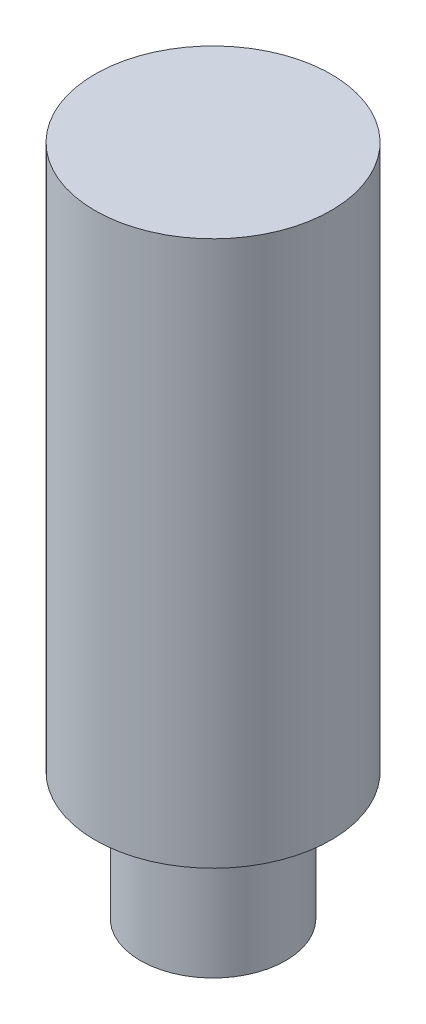
ISO-10303-21;
HEADER;
FILE_DESCRIPTION(('STEP AP214'),'2;1');
FILE_NAME('part.step','',(''),(''),'','','');
FILE_SCHEMA(('AUTOMOTIVE_DESIGN { 1 0 10303 214 1 1 1 1 }'));
ENDSEC;
DATA;
#1=APPLICATION_CONTEXT('core data for automotive mechanical design processes');
#2=APPLICATION_PROTOCOL_DEFINITION('international standard','automotive_design',2000,#1);
#3=PRODUCT_CONTEXT('',#1,'mechanical');
#4=PRODUCT('Part','Part','',(#3));
#5=PRODUCT_RELATED_PRODUCT_CATEGORY('part','',(#4));
#6=PRODUCT_DEFINITION_FORMATION('','',#4);
#7=PRODUCT_DEFINITION_CONTEXT('part definition',#1,'design');
#8=PRODUCT_DEFINITION('design','',#6,#7);
#9=PRODUCT_DEFINITION_SHAPE('','',#8);
#10=(LENGTH_UNIT() NAMED_UNIT(*) SI_UNIT(.MILLI.,.METRE.));
#11=(NAMED_UNIT(*) PLANE_ANGLE_UNIT() SI_UNIT($,.RADIAN.));
#12=(NAMED_UNIT(*) SI_UNIT($,.STERADIAN.) SOLID_ANGLE_UNIT());
#13=UNCERTAINTY_MEASURE_WITH_UNIT(LENGTH_MEASURE(1.E-05),#10,'distance_accuracy_value','');
#14=(GEOMETRIC_REPRESENTATION_CONTEXT(3) GLOBAL_UNCERTAINTY_ASSIGNED_CONTEXT((#13)) GLOBAL_UNIT_ASSIGNED_CONTEXT((#10,
#11,#12)) REPRESENTATION_CONTEXT('',''));
#15=CARTESIAN_POINT('',(0.,0.,0.));
#16=DIRECTION('',(0.,0.,1.));
#17=DIRECTION('',(1.,0.,0.));
#18=AXIS2_PLACEMENT_3D('',#15,#16,#17);
#19=CARTESIAN_POINT('',(0.,3.5,0.));
#20=DIRECTION('',(0.,-1.,0.));
#21=DIRECTION('',(0.,0.,-1.));
#22=AXIS2_PLACEMENT_3D('',#19,#20,#21);
#23=CYLINDRICAL_SURFACE('',#22,4.);
#24=CARTESIAN_POINT('',(0.,3.5,0.));
#25=DIRECTION('',(0.,1.,0.));
#26=DIRECTION('',(0.,0.,1.));
#27=AXIS2_PLACEMENT_3D('',#24,#25,#26);
#28=CIRCLE('',#27,4.);
#29=CARTESIAN_POINT('',(0.,3.5,4.));
#30=VERTEX_POINT('',#29);
#31=EDGE_CURVE('E10',#30,#30,#28,.T.);
#32=ORIENTED_EDGE('',*,*,#31,.F.);
#33=EDGE_LOOP('',(#32));
#34=FACE_BOUND('',#33,.T.);
#35=CARTESIAN_POINT('',(0.,-3.5,0.));
#36=DIRECTION('',(0.,1.,0.));
#37=DIRECTION('',(0.,0.,1.));
#38=AXIS2_PLACEMENT_3D('',#35,#36,#37);
#39=CIRCLE('',#38,4.);
#40=CARTESIAN_POINT('',(0.,-3.5,4.));
#41=VERTEX_POINT('',#40);
#42=EDGE_CURVE('E40',#41,#41,#39,.T.);
#43=ORIENTED_EDGE('',*,*,#42,.T.);
#44=EDGE_LOOP('',(#43));
#45=FACE_BOUND('',#44,.T.);
#46=ADVANCED_FACE('F37',(#34,#45),#23,.T.);
#47=CARTESIAN_POINT('',(0.,-3.5,0.));
#48=DIRECTION('',(0.,1.,0.));
#49=DIRECTION('',(0.,0.,1.));
#50=AXIS2_PLACEMENT_3D('',#47,#48,#49);
#51=PLANE('',#50);
#52=ORIENTED_EDGE('',*,*,#42,.F.);
#53=EDGE_LOOP('',(#52));
#54=FACE_BOUND('',#53,.T.);
#55=ADVANCED_FACE('F64',(#54),#51,.F.);
#56=CARTESIAN_POINT('',(0.,33.5,0.));
#57=DIRECTION('',(0.,-1.,0.));
#58=DIRECTION('',(0.,0.,-1.));
#59=AXIS2_PLACEMENT_3D('',#56,#57,#58);
#60=CYLINDRICAL_SURFACE('',#59,6.5);
#61=CARTESIAN_POINT('',(0.,33.5,0.));
#62=DIRECTION('',(0.,1.,0.));
#63=DIRECTION('',(0.,0.,1.));
#64=AXIS2_PLACEMENT_3D('',#61,#62,#63);
#65=CIRCLE('',#64,6.5);
#66=CARTESIAN_POINT('',(0.,33.5,6.5));
#67=VERTEX_POINT('',#66);
#68=EDGE_CURVE('E49',#67,#67,#65,.T.);
#69=ORIENTED_EDGE('',*,*,#68,.F.);
#70=EDGE_LOOP('',(#69));
#71=FACE_BOUND('',#70,.T.);
#72=CARTESIAN_POINT('',(0.,3.5,0.));
#73=DIRECTION('',(0.,1.,0.));
#74=DIRECTION('',(0.,0.,1.));
#75=AXIS2_PLACEMENT_3D('',#72,#73,#74);
#76=CIRCLE('',#75,6.5);
#77=CARTESIAN_POINT('',(0.,3.5,6.5));
#78=VERTEX_POINT('',#77);
#79=EDGE_CURVE('E51',#78,#78,#76,.T.);
#80=ORIENTED_EDGE('',*,*,#79,.T.);
#81=EDGE_LOOP('',(#80));
#82=FACE_BOUND('',#81,.T.);
#83=ADVANCED_FACE('F61',(#71,#82),#60,.T.);
#84=CARTESIAN_POINT('',(0.,33.5,0.));
#85=DIRECTION('',(0.,1.,0.));
#86=DIRECTION('',(0.,0.,1.));
#87=AXIS2_PLACEMENT_3D('',#84,#85,#86);
#88=PLANE('',#87);
#89=ORIENTED_EDGE('',*,*,#68,.T.);
#90=EDGE_LOOP('',(#89));
#91=FACE_BOUND('',#90,.T.);
#92=ADVANCED_FACE('F59',(#91),#88,.T.);
#93=CARTESIAN_POINT('',(0.,3.5,0.));
#94=DIRECTION('',(0.,1.,0.));
#95=DIRECTION('',(0.,0.,1.));
#96=AXIS2_PLACEMENT_3D('',#93,#94,#95);
#97=PLANE('',#96);
#98=ORIENTED_EDGE('',*,*,#31,.T.);
#99=EDGE_LOOP('',(#98));
#100=FACE_BOUND('',#99,.T.);
#101=ORIENTED_EDGE('',*,*,#79,.F.);
#102=EDGE_LOOP('',(#101));
#103=FACE_BOUND('',#102,.T.);
#104=ADVANCED_FACE('F68',(#100,#103),#97,.F.);
#105=CLOSED_SHELL('',(#46,#55,#83,#92,#104));
#106=MANIFOLD_SOLID_BREP('B2',#105);
#107=ADVANCED_BREP_SHAPE_REPRESENTATION('',(#18,#106),#14);
#108=SHAPE_DEFINITION_REPRESENTATION(#9,#107);
ENDSEC;
END-ISO-10303-21;
